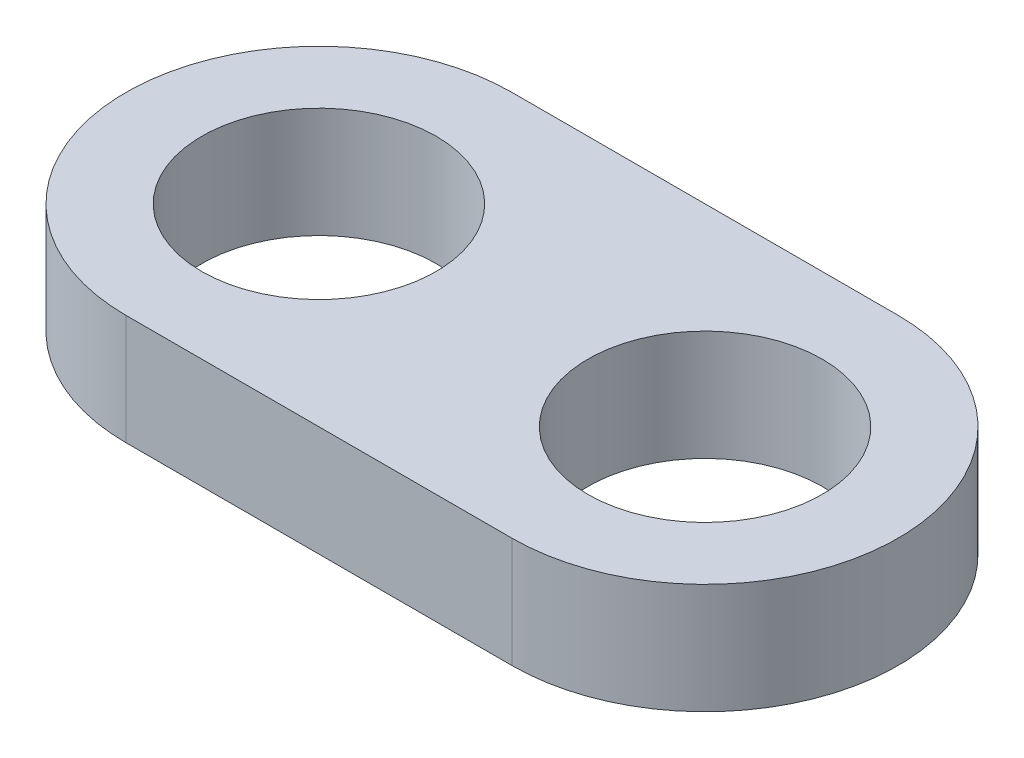
ISO-10303-21;
HEADER;
FILE_DESCRIPTION(('STEP AP214'),'2;1');
FILE_NAME('part.step','',(''),(''),'','','');
FILE_SCHEMA(('AUTOMOTIVE_DESIGN { 1 0 10303 214 1 1 1 1 }'));
ENDSEC;
DATA;
#1=APPLICATION_CONTEXT('core data for automotive mechanical design processes');
#2=APPLICATION_PROTOCOL_DEFINITION('international standard','automotive_design',2000,#1);
#3=PRODUCT_CONTEXT('',#1,'mechanical');
#4=PRODUCT('Part','Part','',(#3));
#5=PRODUCT_RELATED_PRODUCT_CATEGORY('part','',(#4));
#6=PRODUCT_DEFINITION_FORMATION('','',#4);
#7=PRODUCT_DEFINITION_CONTEXT('part definition',#1,'design');
#8=PRODUCT_DEFINITION('design','',#6,#7);
#9=PRODUCT_DEFINITION_SHAPE('','',#8);
#10=(LENGTH_UNIT() NAMED_UNIT(*) SI_UNIT(.MILLI.,.METRE.));
#11=(NAMED_UNIT(*) PLANE_ANGLE_UNIT() SI_UNIT($,.RADIAN.));
#12=(NAMED_UNIT(*) SI_UNIT($,.STERADIAN.) SOLID_ANGLE_UNIT());
#13=UNCERTAINTY_MEASURE_WITH_UNIT(LENGTH_MEASURE(1.E-05),#10,'distance_accuracy_value','');
#14=(GEOMETRIC_REPRESENTATION_CONTEXT(3) GLOBAL_UNCERTAINTY_ASSIGNED_CONTEXT((#13)) GLOBAL_UNIT_ASSIGNED_CONTEXT((#10,
#11,#12)) REPRESENTATION_CONTEXT('',''));
#15=CARTESIAN_POINT('',(0.,0.,0.));
#16=DIRECTION('',(0.,0.,1.));
#17=DIRECTION('',(1.,0.,0.));
#18=AXIS2_PLACEMENT_3D('',#15,#16,#17);
#19=CARTESIAN_POINT('',(-3.5,1.,0.));
#20=DIRECTION('',(0.,1.,0.));
#21=DIRECTION('',(0.,0.,1.));
#22=AXIS2_PLACEMENT_3D('',#19,#20,#21);
#23=PLANE('',#22);
#24=CARTESIAN_POINT('',(-3.5,1.,0.));
#25=DIRECTION('',(0.,1.,0.));
#26=DIRECTION('',(0.,0.,1.));
#27=AXIS2_PLACEMENT_3D('',#24,#25,#26);
#28=CIRCLE('',#27,2.125);
#29=CARTESIAN_POINT('',(-3.5,1.,2.125));
#30=VERTEX_POINT('',#29);
#31=EDGE_CURVE('E100',#30,#30,#28,.T.);
#32=ORIENTED_EDGE('',*,*,#31,.F.);
#33=EDGE_LOOP('',(#32));
#34=FACE_BOUND('',#33,.T.);
#35=CARTESIAN_POINT('',(-3.5,1.,0.));
#36=DIRECTION('',(0.,1.,0.));
#37=DIRECTION('',(0.,0.,1.));
#38=AXIS2_PLACEMENT_3D('',#35,#36,#37);
#39=CIRCLE('',#38,3.5);
#40=CARTESIAN_POINT('',(-3.5,1.,-3.5));
#41=VERTEX_POINT('',#40);
#42=CARTESIAN_POINT('',(-3.5,1.,3.5));
#43=VERTEX_POINT('',#42);
#44=EDGE_CURVE('E85',#41,#43,#39,.T.);
#45=ORIENTED_EDGE('',*,*,#44,.T.);
#46=DIRECTION('',(1.,0.,0.));
#47=VECTOR('',#46,1.);
#48=CARTESIAN_POINT('',(-3.5,1.,3.5));
#49=LINE('',#48,#47);
#50=CARTESIAN_POINT('',(3.5,1.,3.5));
#51=VERTEX_POINT('',#50);
#52=EDGE_CURVE('E80',#43,#51,#49,.T.);
#53=ORIENTED_EDGE('',*,*,#52,.T.);
#54=CARTESIAN_POINT('',(3.5,1.,0.));
#55=DIRECTION('',(0.,1.,0.));
#56=DIRECTION('',(0.,0.,1.));
#57=AXIS2_PLACEMENT_3D('',#54,#55,#56);
#58=CIRCLE('',#57,3.5);
#59=CARTESIAN_POINT('',(3.5,1.,-3.5));
#60=VERTEX_POINT('',#59);
#61=EDGE_CURVE('E83',#51,#60,#58,.T.);
#62=ORIENTED_EDGE('',*,*,#61,.T.);
#63=DIRECTION('',(-1.,0.,0.));
#64=VECTOR('',#63,1.);
#65=CARTESIAN_POINT('',(-3.5,1.,-3.5));
#66=LINE('',#65,#64);
#67=EDGE_CURVE('E50',#60,#41,#66,.T.);
#68=ORIENTED_EDGE('',*,*,#67,.T.);
#69=EDGE_LOOP('',(#45,#53,#62,#68));
#70=FACE_BOUND('',#69,.T.);
#71=CARTESIAN_POINT('',(3.5,1.,0.));
#72=DIRECTION('',(0.,1.,0.));
#73=DIRECTION('',(0.,0.,1.));
#74=AXIS2_PLACEMENT_3D('',#71,#72,#73);
#75=CIRCLE('',#74,2.125);
#76=CARTESIAN_POINT('',(3.5,1.,2.125));
#77=VERTEX_POINT('',#76);
#78=EDGE_CURVE('E115',#77,#77,#75,.T.);
#79=ORIENTED_EDGE('',*,*,#78,.F.);
#80=EDGE_LOOP('',(#79));
#81=FACE_BOUND('',#80,.T.);
#82=ADVANCED_FACE('F33',(#34,#70,#81),#23,.T.);
#83=CARTESIAN_POINT('',(-3.5,-1.,0.));
#84=DIRECTION('',(0.,1.,0.));
#85=DIRECTION('',(0.,0.,1.));
#86=AXIS2_PLACEMENT_3D('',#83,#84,#85);
#87=PLANE('',#86);
#88=CARTESIAN_POINT('',(-3.5,-1.,0.));
#89=DIRECTION('',(0.,1.,0.));
#90=DIRECTION('',(0.,0.,1.));
#91=AXIS2_PLACEMENT_3D('',#88,#89,#90);
#92=CIRCLE('',#91,3.5);
#93=CARTESIAN_POINT('',(-3.5,-1.,-3.5));
#94=VERTEX_POINT('',#93);
#95=CARTESIAN_POINT('',(-3.5,-1.,3.5));
#96=VERTEX_POINT('',#95);
#97=EDGE_CURVE('E97',#94,#96,#92,.T.);
#98=ORIENTED_EDGE('',*,*,#97,.F.);
#99=DIRECTION('',(-1.,0.,0.));
#100=VECTOR('',#99,1.);
#101=CARTESIAN_POINT('',(-3.5,-1.,-3.5));
#102=LINE('',#101,#100);
#103=CARTESIAN_POINT('',(3.5,-1.,-3.5));
#104=VERTEX_POINT('',#103);
#105=EDGE_CURVE('E73',#104,#94,#102,.T.);
#106=ORIENTED_EDGE('',*,*,#105,.F.);
#107=CARTESIAN_POINT('',(3.5,-1.,0.));
#108=DIRECTION('',(0.,1.,0.));
#109=DIRECTION('',(0.,0.,1.));
#110=AXIS2_PLACEMENT_3D('',#107,#108,#109);
#111=CIRCLE('',#110,3.5);
#112=CARTESIAN_POINT('',(3.5,-1.,3.5));
#113=VERTEX_POINT('',#112);
#114=EDGE_CURVE('E67',#113,#104,#111,.T.);
#115=ORIENTED_EDGE('',*,*,#114,.F.);
#116=DIRECTION('',(1.,0.,0.));
#117=VECTOR('',#116,1.);
#118=CARTESIAN_POINT('',(-3.5,-1.,3.5));
#119=LINE('',#118,#117);
#120=EDGE_CURVE('E89',#96,#113,#119,.T.);
#121=ORIENTED_EDGE('',*,*,#120,.F.);
#122=EDGE_LOOP('',(#98,#106,#115,#121));
#123=FACE_BOUND('',#122,.T.);
#124=CARTESIAN_POINT('',(-3.5,-1.,0.));
#125=DIRECTION('',(0.,1.,0.));
#126=DIRECTION('',(0.,0.,1.));
#127=AXIS2_PLACEMENT_3D('',#124,#125,#126);
#128=CIRCLE('',#127,2.125);
#129=CARTESIAN_POINT('',(-3.5,-1.,2.125));
#130=VERTEX_POINT('',#129);
#131=EDGE_CURVE('E112',#130,#130,#128,.T.);
#132=ORIENTED_EDGE('',*,*,#131,.T.);
#133=EDGE_LOOP('',(#132));
#134=FACE_BOUND('',#133,.T.);
#135=CARTESIAN_POINT('',(3.5,-1.,0.));
#136=DIRECTION('',(0.,1.,0.));
#137=DIRECTION('',(0.,0.,1.));
#138=AXIS2_PLACEMENT_3D('',#135,#136,#137);
#139=CIRCLE('',#138,2.125);
#140=CARTESIAN_POINT('',(3.5,-1.,2.125));
#141=VERTEX_POINT('',#140);
#142=EDGE_CURVE('E118',#141,#141,#139,.T.);
#143=ORIENTED_EDGE('',*,*,#142,.T.);
#144=EDGE_LOOP('',(#143));
#145=FACE_BOUND('',#144,.T.);
#146=ADVANCED_FACE('F108',(#123,#134,#145),#87,.F.);
#147=CARTESIAN_POINT('',(-3.5,1.,0.));
#148=DIRECTION('',(0.,-1.,0.));
#149=DIRECTION('',(0.,0.,-1.));
#150=AXIS2_PLACEMENT_3D('',#147,#148,#149);
#151=CYLINDRICAL_SURFACE('',#150,3.5);
#152=ORIENTED_EDGE('',*,*,#97,.T.);
#153=DIRECTION('',(0.,-1.,0.));
#154=VECTOR('',#153,1.);
#155=CARTESIAN_POINT('',(-3.5,1.,3.5));
#156=LINE('',#155,#154);
#157=EDGE_CURVE('E11',#43,#96,#156,.T.);
#158=ORIENTED_EDGE('',*,*,#157,.F.);
#159=ORIENTED_EDGE('',*,*,#44,.F.);
#160=DIRECTION('',(0.,-1.,0.));
#161=VECTOR('',#160,1.);
#162=CARTESIAN_POINT('',(-3.5,1.,-3.5));
#163=LINE('',#162,#161);
#164=EDGE_CURVE('E93',#41,#94,#163,.T.);
#165=ORIENTED_EDGE('',*,*,#164,.T.);
#166=EDGE_LOOP('',(#152,#158,#159,#165));
#167=FACE_BOUND('',#166,.T.);
#168=ADVANCED_FACE('F35',(#167),#151,.T.);
#169=CARTESIAN_POINT('',(-3.5,1.,3.5));
#170=DIRECTION('',(0.,0.,-1.));
#171=DIRECTION('',(-1.,0.,0.));
#172=AXIS2_PLACEMENT_3D('',#169,#170,#171);
#173=PLANE('',#172);
#174=ORIENTED_EDGE('',*,*,#120,.T.);
#175=DIRECTION('',(0.,-1.,0.));
#176=VECTOR('',#175,1.);
#177=CARTESIAN_POINT('',(3.5,1.,3.5));
#178=LINE('',#177,#176);
#179=EDGE_CURVE('E42',#51,#113,#178,.T.);
#180=ORIENTED_EDGE('',*,*,#179,.F.);
#181=ORIENTED_EDGE('',*,*,#52,.F.);
#182=ORIENTED_EDGE('',*,*,#157,.T.);
#183=EDGE_LOOP('',(#174,#180,#181,#182));
#184=FACE_BOUND('',#183,.T.);
#185=ADVANCED_FACE('F88',(#184),#173,.F.);
#186=CARTESIAN_POINT('',(3.5,1.,0.));
#187=DIRECTION('',(0.,-1.,0.));
#188=DIRECTION('',(0.,0.,-1.));
#189=AXIS2_PLACEMENT_3D('',#186,#187,#188);
#190=CYLINDRICAL_SURFACE('',#189,3.5);
#191=ORIENTED_EDGE('',*,*,#114,.T.);
#192=DIRECTION('',(0.,-1.,0.));
#193=VECTOR('',#192,1.);
#194=CARTESIAN_POINT('',(3.5,1.,-3.5));
#195=LINE('',#194,#193);
#196=EDGE_CURVE('E90',#60,#104,#195,.T.);
#197=ORIENTED_EDGE('',*,*,#196,.F.);
#198=ORIENTED_EDGE('',*,*,#61,.F.);
#199=ORIENTED_EDGE('',*,*,#179,.T.);
#200=EDGE_LOOP('',(#191,#197,#198,#199));
#201=FACE_BOUND('',#200,.T.);
#202=ADVANCED_FACE('F91',(#201),#190,.T.);
#203=CARTESIAN_POINT('',(-3.5,1.,-3.5));
#204=DIRECTION('',(0.,0.,1.));
#205=DIRECTION('',(1.,0.,0.));
#206=AXIS2_PLACEMENT_3D('',#203,#204,#205);
#207=PLANE('',#206);
#208=ORIENTED_EDGE('',*,*,#105,.T.);
#209=ORIENTED_EDGE('',*,*,#164,.F.);
#210=ORIENTED_EDGE('',*,*,#67,.F.);
#211=ORIENTED_EDGE('',*,*,#196,.T.);
#212=EDGE_LOOP('',(#208,#209,#210,#211));
#213=FACE_BOUND('',#212,.T.);
#214=ADVANCED_FACE('F105',(#213),#207,.F.);
#215=CARTESIAN_POINT('',(-3.5,1.,0.));
#216=DIRECTION('',(0.,-1.,0.));
#217=DIRECTION('',(0.,0.,-1.));
#218=AXIS2_PLACEMENT_3D('',#215,#216,#217);
#219=CYLINDRICAL_SURFACE('',#218,2.125);
#220=ORIENTED_EDGE('',*,*,#31,.T.);
#221=EDGE_LOOP('',(#220));
#222=FACE_BOUND('',#221,.T.);
#223=ORIENTED_EDGE('',*,*,#131,.F.);
#224=EDGE_LOOP('',(#223));
#225=FACE_BOUND('',#224,.T.);
#226=ADVANCED_FACE('F135',(#222,#225),#219,.F.);
#227=CARTESIAN_POINT('',(3.5,1.,0.));
#228=DIRECTION('',(0.,-1.,0.));
#229=DIRECTION('',(0.,0.,-1.));
#230=AXIS2_PLACEMENT_3D('',#227,#228,#229);
#231=CYLINDRICAL_SURFACE('',#230,2.125);
#232=ORIENTED_EDGE('',*,*,#78,.T.);
#233=EDGE_LOOP('',(#232));
#234=FACE_BOUND('',#233,.T.);
#235=ORIENTED_EDGE('',*,*,#142,.F.);
#236=EDGE_LOOP('',(#235));
#237=FACE_BOUND('',#236,.T.);
#238=ADVANCED_FACE('F124',(#234,#237),#231,.F.);
#239=CLOSED_SHELL('',(#82,#146,#168,#185,#202,#214,#226,#238));
#240=MANIFOLD_SOLID_BREP('B2',#239);
#241=ADVANCED_BREP_SHAPE_REPRESENTATION('',(#18,#240),#14);
#242=SHAPE_DEFINITION_REPRESENTATION(#9,#241);
ENDSEC;
END-ISO-10303-21;
